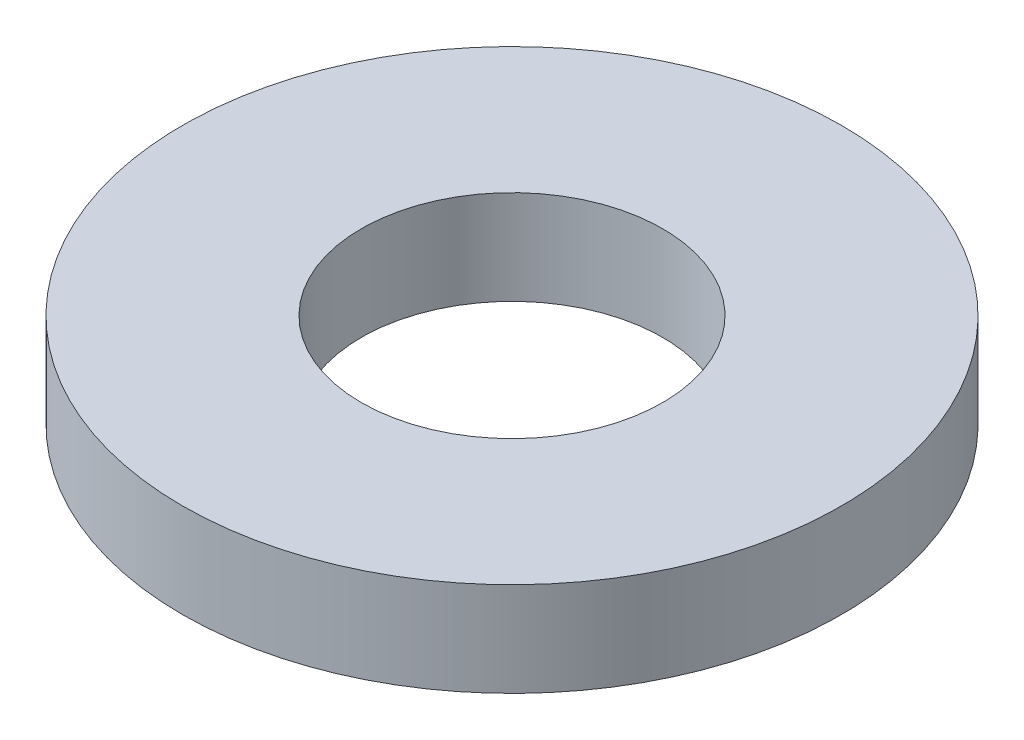
ISO-10303-21;
HEADER;
FILE_DESCRIPTION(('STEP AP214'),'2;1');
FILE_NAME('part.step','',(''),(''),'','','');
FILE_SCHEMA(('AUTOMOTIVE_DESIGN { 1 0 10303 214 1 1 1 1 }'));
ENDSEC;
DATA;
#1=APPLICATION_CONTEXT('core data for automotive mechanical design processes');
#2=APPLICATION_PROTOCOL_DEFINITION('international standard','automotive_design',2000,#1);
#3=PRODUCT_CONTEXT('',#1,'mechanical');
#4=PRODUCT('Part','Part','',(#3));
#5=PRODUCT_RELATED_PRODUCT_CATEGORY('part','',(#4));
#6=PRODUCT_DEFINITION_FORMATION('','',#4);
#7=PRODUCT_DEFINITION_CONTEXT('part definition',#1,'design');
#8=PRODUCT_DEFINITION('design','',#6,#7);
#9=PRODUCT_DEFINITION_SHAPE('','',#8);
#10=(LENGTH_UNIT() NAMED_UNIT(*) SI_UNIT(.MILLI.,.METRE.));
#11=(NAMED_UNIT(*) PLANE_ANGLE_UNIT() SI_UNIT($,.RADIAN.));
#12=(NAMED_UNIT(*) SI_UNIT($,.STERADIAN.) SOLID_ANGLE_UNIT());
#13=UNCERTAINTY_MEASURE_WITH_UNIT(LENGTH_MEASURE(1.E-05),#10,'distance_accuracy_value','');
#14=(GEOMETRIC_REPRESENTATION_CONTEXT(3) GLOBAL_UNCERTAINTY_ASSIGNED_CONTEXT((#13)) GLOBAL_UNIT_ASSIGNED_CONTEXT((#10,
#11,#12)) REPRESENTATION_CONTEXT('',''));
#15=CARTESIAN_POINT('',(0.,0.,0.));
#16=DIRECTION('',(0.,0.,1.));
#17=DIRECTION('',(1.,0.,0.));
#18=AXIS2_PLACEMENT_3D('',#15,#16,#17);
#19=CARTESIAN_POINT('',(0.,5.,0.));
#20=DIRECTION('',(0.,1.,0.));
#21=DIRECTION('',(0.,0.,1.));
#22=AXIS2_PLACEMENT_3D('',#19,#20,#21);
#23=PLANE('',#22);
#24=CARTESIAN_POINT('',(0.,5.,0.));
#25=DIRECTION('',(0.,1.,0.));
#26=DIRECTION('',(0.,0.,1.));
#27=AXIS2_PLACEMENT_3D('',#24,#25,#26);
#28=CIRCLE('',#27,17.5);
#29=CARTESIAN_POINT('',(0.,5.,17.5));
#30=VERTEX_POINT('',#29);
#31=EDGE_CURVE('E10',#30,#30,#28,.T.);
#32=ORIENTED_EDGE('',*,*,#31,.T.);
#33=EDGE_LOOP('',(#32));
#34=FACE_BOUND('',#33,.T.);
#35=CARTESIAN_POINT('',(0.,5.,0.));
#36=DIRECTION('',(0.,1.,0.));
#37=DIRECTION('',(0.,0.,1.));
#38=AXIS2_PLACEMENT_3D('',#35,#36,#37);
#39=CIRCLE('',#38,8.);
#40=CARTESIAN_POINT('',(0.,5.,8.));
#41=VERTEX_POINT('',#40);
#42=EDGE_CURVE('E46',#41,#41,#39,.T.);
#43=ORIENTED_EDGE('',*,*,#42,.F.);
#44=EDGE_LOOP('',(#43));
#45=FACE_BOUND('',#44,.T.);
#46=ADVANCED_FACE('F35',(#34,#45),#23,.T.);
#47=CARTESIAN_POINT('',(0.,0.,0.));
#48=DIRECTION('',(0.,1.,0.));
#49=DIRECTION('',(0.,0.,1.));
#50=AXIS2_PLACEMENT_3D('',#47,#48,#49);
#51=PLANE('',#50);
#52=CARTESIAN_POINT('',(0.,0.,0.));
#53=DIRECTION('',(0.,1.,0.));
#54=DIRECTION('',(0.,0.,1.));
#55=AXIS2_PLACEMENT_3D('',#52,#53,#54);
#56=CIRCLE('',#55,17.5);
#57=CARTESIAN_POINT('',(0.,0.,17.5));
#58=VERTEX_POINT('',#57);
#59=EDGE_CURVE('E39',#58,#58,#56,.T.);
#60=ORIENTED_EDGE('',*,*,#59,.F.);
#61=EDGE_LOOP('',(#60));
#62=FACE_BOUND('',#61,.T.);
#63=CARTESIAN_POINT('',(0.,0.,0.));
#64=DIRECTION('',(0.,1.,0.));
#65=DIRECTION('',(0.,0.,1.));
#66=AXIS2_PLACEMENT_3D('',#63,#64,#65);
#67=CIRCLE('',#66,8.);
#68=CARTESIAN_POINT('',(0.,0.,8.));
#69=VERTEX_POINT('',#68);
#70=EDGE_CURVE('E48',#69,#69,#67,.T.);
#71=ORIENTED_EDGE('',*,*,#70,.T.);
#72=EDGE_LOOP('',(#71));
#73=FACE_BOUND('',#72,.T.);
#74=ADVANCED_FACE('F58',(#62,#73),#51,.F.);
#75=CARTESIAN_POINT('',(0.,5.,0.));
#76=DIRECTION('',(0.,-1.,0.));
#77=DIRECTION('',(0.,0.,-1.));
#78=AXIS2_PLACEMENT_3D('',#75,#76,#77);
#79=CYLINDRICAL_SURFACE('',#78,17.5);
#80=ORIENTED_EDGE('',*,*,#31,.F.);
#81=EDGE_LOOP('',(#80));
#82=FACE_BOUND('',#81,.T.);
#83=ORIENTED_EDGE('',*,*,#59,.T.);
#84=EDGE_LOOP('',(#83));
#85=FACE_BOUND('',#84,.T.);
#86=ADVANCED_FACE('F37',(#82,#85),#79,.T.);
#87=CARTESIAN_POINT('',(0.,5.,0.));
#88=DIRECTION('',(0.,-1.,0.));
#89=DIRECTION('',(0.,0.,-1.));
#90=AXIS2_PLACEMENT_3D('',#87,#88,#89);
#91=CYLINDRICAL_SURFACE('',#90,8.);
#92=ORIENTED_EDGE('',*,*,#42,.T.);
#93=EDGE_LOOP('',(#92));
#94=FACE_BOUND('',#93,.T.);
#95=ORIENTED_EDGE('',*,*,#70,.F.);
#96=EDGE_LOOP('',(#95));
#97=FACE_BOUND('',#96,.T.);
#98=ADVANCED_FACE('F54',(#94,#97),#91,.F.);
#99=CLOSED_SHELL('',(#46,#74,#86,#98));
#100=MANIFOLD_SOLID_BREP('B2',#99);
#101=ADVANCED_BREP_SHAPE_REPRESENTATION('',(#18,#100),#14);
#102=SHAPE_DEFINITION_REPRESENTATION(#9,#101);
ENDSEC;
END-ISO-10303-21;
